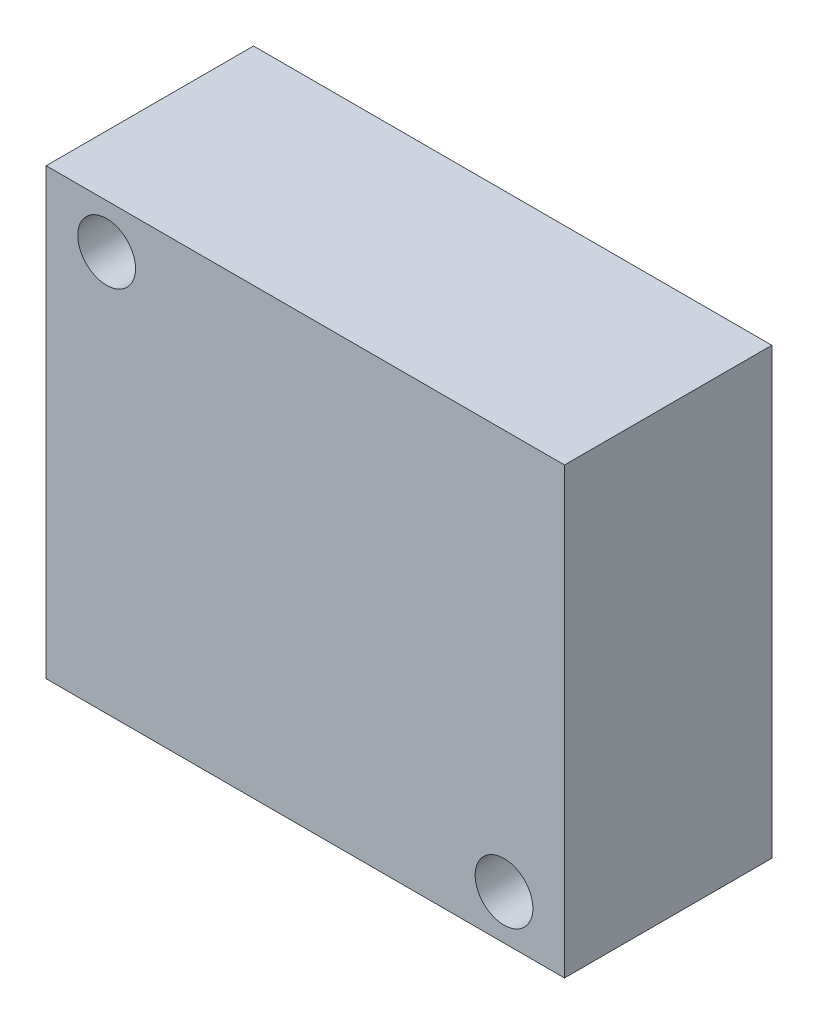
ISO-10303-21;
HEADER;
FILE_DESCRIPTION(('STEP AP214'),'2;1');
FILE_NAME('part.step','',(''),(''),'','','');
FILE_SCHEMA(('AUTOMOTIVE_DESIGN { 1 0 10303 214 1 1 1 1 }'));
ENDSEC;
DATA;
#1=APPLICATION_CONTEXT('core data for automotive mechanical design processes');
#2=APPLICATION_PROTOCOL_DEFINITION('international standard','automotive_design',2000,#1);
#3=PRODUCT_CONTEXT('',#1,'mechanical');
#4=PRODUCT('Part','Part','',(#3));
#5=PRODUCT_RELATED_PRODUCT_CATEGORY('part','',(#4));
#6=PRODUCT_DEFINITION_FORMATION('','',#4);
#7=PRODUCT_DEFINITION_CONTEXT('part definition',#1,'design');
#8=PRODUCT_DEFINITION('design','',#6,#7);
#9=PRODUCT_DEFINITION_SHAPE('','',#8);
#10=(LENGTH_UNIT() NAMED_UNIT(*) SI_UNIT(.MILLI.,.METRE.));
#11=(NAMED_UNIT(*) PLANE_ANGLE_UNIT() SI_UNIT($,.RADIAN.));
#12=(NAMED_UNIT(*) SI_UNIT($,.STERADIAN.) SOLID_ANGLE_UNIT());
#13=UNCERTAINTY_MEASURE_WITH_UNIT(LENGTH_MEASURE(1.E-05),#10,'distance_accuracy_value','');
#14=(GEOMETRIC_REPRESENTATION_CONTEXT(3) GLOBAL_UNCERTAINTY_ASSIGNED_CONTEXT((#13)) GLOBAL_UNIT_ASSIGNED_CONTEXT((#10,
#11,#12)) REPRESENTATION_CONTEXT('',''));
#15=CARTESIAN_POINT('',(0.,0.,0.));
#16=DIRECTION('',(0.,0.,1.));
#17=DIRECTION('',(1.,0.,0.));
#18=AXIS2_PLACEMENT_3D('',#15,#16,#17);
#19=CARTESIAN_POINT('',(17.5,-15.,14.));
#20=DIRECTION('',(-1.,0.,0.));
#21=DIRECTION('',(0.,0.,1.));
#22=AXIS2_PLACEMENT_3D('',#19,#20,#21);
#23=PLANE('',#22);
#24=DIRECTION('',(0.,1.,0.));
#25=VECTOR('',#24,1.);
#26=CARTESIAN_POINT('',(17.5,-15.,0.));
#27=LINE('',#26,#25);
#28=CARTESIAN_POINT('',(17.5,-15.,0.));
#29=VERTEX_POINT('',#28);
#30=CARTESIAN_POINT('',(17.5,15.,0.));
#31=VERTEX_POINT('',#30);
#32=EDGE_CURVE('E95',#29,#31,#27,.T.);
#33=ORIENTED_EDGE('',*,*,#32,.T.);
#34=DIRECTION('',(0.,0.,-1.));
#35=VECTOR('',#34,1.);
#36=CARTESIAN_POINT('',(17.5,15.,14.));
#37=LINE('',#36,#35);
#38=CARTESIAN_POINT('',(17.5,15.,14.));
#39=VERTEX_POINT('',#38);
#40=EDGE_CURVE('E11',#39,#31,#37,.T.);
#41=ORIENTED_EDGE('',*,*,#40,.F.);
#42=DIRECTION('',(0.,1.,0.));
#43=VECTOR('',#42,1.);
#44=CARTESIAN_POINT('',(17.5,-15.,14.));
#45=LINE('',#44,#43);
#46=CARTESIAN_POINT('',(17.5,-15.,14.));
#47=VERTEX_POINT('',#46);
#48=EDGE_CURVE('E83',#47,#39,#45,.T.);
#49=ORIENTED_EDGE('',*,*,#48,.F.);
#50=DIRECTION('',(0.,0.,-1.));
#51=VECTOR('',#50,1.);
#52=CARTESIAN_POINT('',(17.5,-15.,14.));
#53=LINE('',#52,#51);
#54=EDGE_CURVE('E91',#47,#29,#53,.T.);
#55=ORIENTED_EDGE('',*,*,#54,.T.);
#56=EDGE_LOOP('',(#33,#41,#49,#55));
#57=FACE_BOUND('',#56,.T.);
#58=ADVANCED_FACE('F32',(#57),#23,.F.);
#59=CARTESIAN_POINT('',(-17.5,15.,14.));
#60=DIRECTION('',(0.,-1.,0.));
#61=DIRECTION('',(0.,0.,-1.));
#62=AXIS2_PLACEMENT_3D('',#59,#60,#61);
#63=PLANE('',#62);
#64=DIRECTION('',(-1.,0.,0.));
#65=VECTOR('',#64,1.);
#66=CARTESIAN_POINT('',(-17.5,15.,0.));
#67=LINE('',#66,#65);
#68=CARTESIAN_POINT('',(-17.5,15.,0.));
#69=VERTEX_POINT('',#68);
#70=EDGE_CURVE('E87',#31,#69,#67,.T.);
#71=ORIENTED_EDGE('',*,*,#70,.T.);
#72=DIRECTION('',(0.,0.,-1.));
#73=VECTOR('',#72,1.);
#74=CARTESIAN_POINT('',(-17.5,15.,14.));
#75=LINE('',#74,#73);
#76=CARTESIAN_POINT('',(-17.5,15.,14.));
#77=VERTEX_POINT('',#76);
#78=EDGE_CURVE('E40',#77,#69,#75,.T.);
#79=ORIENTED_EDGE('',*,*,#78,.F.);
#80=DIRECTION('',(-1.,0.,0.));
#81=VECTOR('',#80,1.);
#82=CARTESIAN_POINT('',(-17.5,15.,14.));
#83=LINE('',#82,#81);
#84=EDGE_CURVE('E78',#39,#77,#83,.T.);
#85=ORIENTED_EDGE('',*,*,#84,.F.);
#86=ORIENTED_EDGE('',*,*,#40,.T.);
#87=EDGE_LOOP('',(#71,#79,#85,#86));
#88=FACE_BOUND('',#87,.T.);
#89=ADVANCED_FACE('F86',(#88),#63,.F.);
#90=CARTESIAN_POINT('',(-17.5,-15.,14.));
#91=DIRECTION('',(1.,0.,0.));
#92=DIRECTION('',(0.,0.,-1.));
#93=AXIS2_PLACEMENT_3D('',#90,#91,#92);
#94=PLANE('',#93);
#95=DIRECTION('',(0.,-1.,0.));
#96=VECTOR('',#95,1.);
#97=CARTESIAN_POINT('',(-17.5,-15.,0.));
#98=LINE('',#97,#96);
#99=CARTESIAN_POINT('',(-17.5,-15.,0.));
#100=VERTEX_POINT('',#99);
#101=EDGE_CURVE('E65',#69,#100,#98,.T.);
#102=ORIENTED_EDGE('',*,*,#101,.T.);
#103=DIRECTION('',(0.,0.,-1.));
#104=VECTOR('',#103,1.);
#105=CARTESIAN_POINT('',(-17.5,-15.,14.));
#106=LINE('',#105,#104);
#107=CARTESIAN_POINT('',(-17.5,-15.,14.));
#108=VERTEX_POINT('',#107);
#109=EDGE_CURVE('E88',#108,#100,#106,.T.);
#110=ORIENTED_EDGE('',*,*,#109,.F.);
#111=DIRECTION('',(0.,-1.,0.));
#112=VECTOR('',#111,1.);
#113=CARTESIAN_POINT('',(-17.5,-15.,14.));
#114=LINE('',#113,#112);
#115=EDGE_CURVE('E81',#77,#108,#114,.T.);
#116=ORIENTED_EDGE('',*,*,#115,.F.);
#117=ORIENTED_EDGE('',*,*,#78,.T.);
#118=EDGE_LOOP('',(#102,#110,#116,#117));
#119=FACE_BOUND('',#118,.T.);
#120=ADVANCED_FACE('F89',(#119),#94,.F.);
#121=CARTESIAN_POINT('',(-17.5,-15.,14.));
#122=DIRECTION('',(0.,1.,0.));
#123=DIRECTION('',(0.,0.,1.));
#124=AXIS2_PLACEMENT_3D('',#121,#122,#123);
#125=PLANE('',#124);
#126=DIRECTION('',(1.,0.,0.));
#127=VECTOR('',#126,1.);
#128=CARTESIAN_POINT('',(-17.5,-15.,0.));
#129=LINE('',#128,#127);
#130=EDGE_CURVE('E71',#100,#29,#129,.T.);
#131=ORIENTED_EDGE('',*,*,#130,.T.);
#132=ORIENTED_EDGE('',*,*,#54,.F.);
#133=DIRECTION('',(1.,0.,0.));
#134=VECTOR('',#133,1.);
#135=CARTESIAN_POINT('',(-17.5,-15.,14.));
#136=LINE('',#135,#134);
#137=EDGE_CURVE('E48',#108,#47,#136,.T.);
#138=ORIENTED_EDGE('',*,*,#137,.F.);
#139=ORIENTED_EDGE('',*,*,#109,.T.);
#140=EDGE_LOOP('',(#131,#132,#138,#139));
#141=FACE_BOUND('',#140,.T.);
#142=ADVANCED_FACE('F103',(#141),#125,.F.);
#143=CARTESIAN_POINT('',(0.,0.,14.));
#144=DIRECTION('',(0.,0.,-1.));
#145=DIRECTION('',(-1.,0.,0.));
#146=AXIS2_PLACEMENT_3D('',#143,#144,#145);
#147=PLANE('',#146);
#148=CARTESIAN_POINT('',(-13.4164078649987,12.,14.));
#149=DIRECTION('',(0.,0.,1.));
#150=DIRECTION('',(1.,0.,0.));
#151=AXIS2_PLACEMENT_3D('',#148,#149,#150);
#152=CIRCLE('',#151,1.94999999999999);
#153=CARTESIAN_POINT('',(-11.4664078649987,12.,14.));
#154=VERTEX_POINT('',#153);
#155=EDGE_CURVE('E117',#154,#154,#152,.T.);
#156=ORIENTED_EDGE('',*,*,#155,.F.);
#157=EDGE_LOOP('',(#156));
#158=FACE_BOUND('',#157,.T.);
#159=CARTESIAN_POINT('',(13.4164078649987,-12.,14.));
#160=DIRECTION('',(0.,0.,1.));
#161=DIRECTION('',(1.,0.,0.));
#162=AXIS2_PLACEMENT_3D('',#159,#160,#161);
#163=CIRCLE('',#162,1.94999999999999);
#164=CARTESIAN_POINT('',(15.3664078649987,-12.,14.));
#165=VERTEX_POINT('',#164);
#166=EDGE_CURVE('E111',#165,#165,#163,.T.);
#167=ORIENTED_EDGE('',*,*,#166,.F.);
#168=EDGE_LOOP('',(#167));
#169=FACE_BOUND('',#168,.T.);
#170=ORIENTED_EDGE('',*,*,#48,.T.);
#171=ORIENTED_EDGE('',*,*,#84,.T.);
#172=ORIENTED_EDGE('',*,*,#115,.T.);
#173=ORIENTED_EDGE('',*,*,#137,.T.);
#174=EDGE_LOOP('',(#170,#171,#172,#173));
#175=FACE_BOUND('',#174,.T.);
#176=ADVANCED_FACE('F79',(#158,#169,#175),#147,.F.);
#177=CARTESIAN_POINT('',(0.,0.,0.));
#178=DIRECTION('',(0.,0.,-1.));
#179=DIRECTION('',(-1.,0.,0.));
#180=AXIS2_PLACEMENT_3D('',#177,#178,#179);
#181=PLANE('',#180);
#182=CARTESIAN_POINT('',(-13.4164078649987,12.,0.));
#183=DIRECTION('',(0.,0.,1.));
#184=DIRECTION('',(1.,0.,0.));
#185=AXIS2_PLACEMENT_3D('',#182,#183,#184);
#186=CIRCLE('',#185,1.95);
#187=CARTESIAN_POINT('',(-11.4664078649987,12.,0.));
#188=VERTEX_POINT('',#187);
#189=EDGE_CURVE('E114',#188,#188,#186,.T.);
#190=ORIENTED_EDGE('',*,*,#189,.T.);
#191=EDGE_LOOP('',(#190));
#192=FACE_BOUND('',#191,.T.);
#193=CARTESIAN_POINT('',(13.4164078649987,-12.,0.));
#194=DIRECTION('',(0.,0.,1.));
#195=DIRECTION('',(1.,0.,0.));
#196=AXIS2_PLACEMENT_3D('',#193,#194,#195);
#197=CIRCLE('',#196,1.95);
#198=CARTESIAN_POINT('',(15.3664078649987,-12.,0.));
#199=VERTEX_POINT('',#198);
#200=EDGE_CURVE('E98',#199,#199,#197,.T.);
#201=ORIENTED_EDGE('',*,*,#200,.T.);
#202=EDGE_LOOP('',(#201));
#203=FACE_BOUND('',#202,.T.);
#204=ORIENTED_EDGE('',*,*,#32,.F.);
#205=ORIENTED_EDGE('',*,*,#130,.F.);
#206=ORIENTED_EDGE('',*,*,#101,.F.);
#207=ORIENTED_EDGE('',*,*,#70,.F.);
#208=EDGE_LOOP('',(#204,#205,#206,#207));
#209=FACE_BOUND('',#208,.T.);
#210=ADVANCED_FACE('F106',(#192,#203,#209),#181,.T.);
#211=CARTESIAN_POINT('',(13.4164078649987,-12.,14.));
#212=DIRECTION('',(0.,0.,1.));
#213=DIRECTION('',(1.,0.,0.));
#214=AXIS2_PLACEMENT_3D('',#211,#212,#213);
#215=CYLINDRICAL_SURFACE('',#214,1.94999999999999);
#216=ORIENTED_EDGE('',*,*,#200,.F.);
#217=EDGE_LOOP('',(#216));
#218=FACE_BOUND('',#217,.T.);
#219=ORIENTED_EDGE('',*,*,#166,.T.);
#220=EDGE_LOOP('',(#219));
#221=FACE_BOUND('',#220,.T.);
#222=ADVANCED_FACE('F128',(#218,#221),#215,.F.);
#223=CARTESIAN_POINT('',(-13.4164078649987,12.,14.));
#224=DIRECTION('',(0.,0.,1.));
#225=DIRECTION('',(1.,0.,0.));
#226=AXIS2_PLACEMENT_3D('',#223,#224,#225);
#227=CYLINDRICAL_SURFACE('',#226,1.94999999999999);
#228=ORIENTED_EDGE('',*,*,#189,.F.);
#229=EDGE_LOOP('',(#228));
#230=FACE_BOUND('',#229,.T.);
#231=ORIENTED_EDGE('',*,*,#155,.T.);
#232=EDGE_LOOP('',(#231));
#233=FACE_BOUND('',#232,.T.);
#234=ADVANCED_FACE('F121',(#230,#233),#227,.F.);
#235=CLOSED_SHELL('',(#58,#89,#120,#142,#176,#210,#222,#234));
#236=MANIFOLD_SOLID_BREP('B2',#235);
#237=ADVANCED_BREP_SHAPE_REPRESENTATION('',(#18,#236),#14);
#238=SHAPE_DEFINITION_REPRESENTATION(#9,#237);
ENDSEC;
END-ISO-10303-21;
